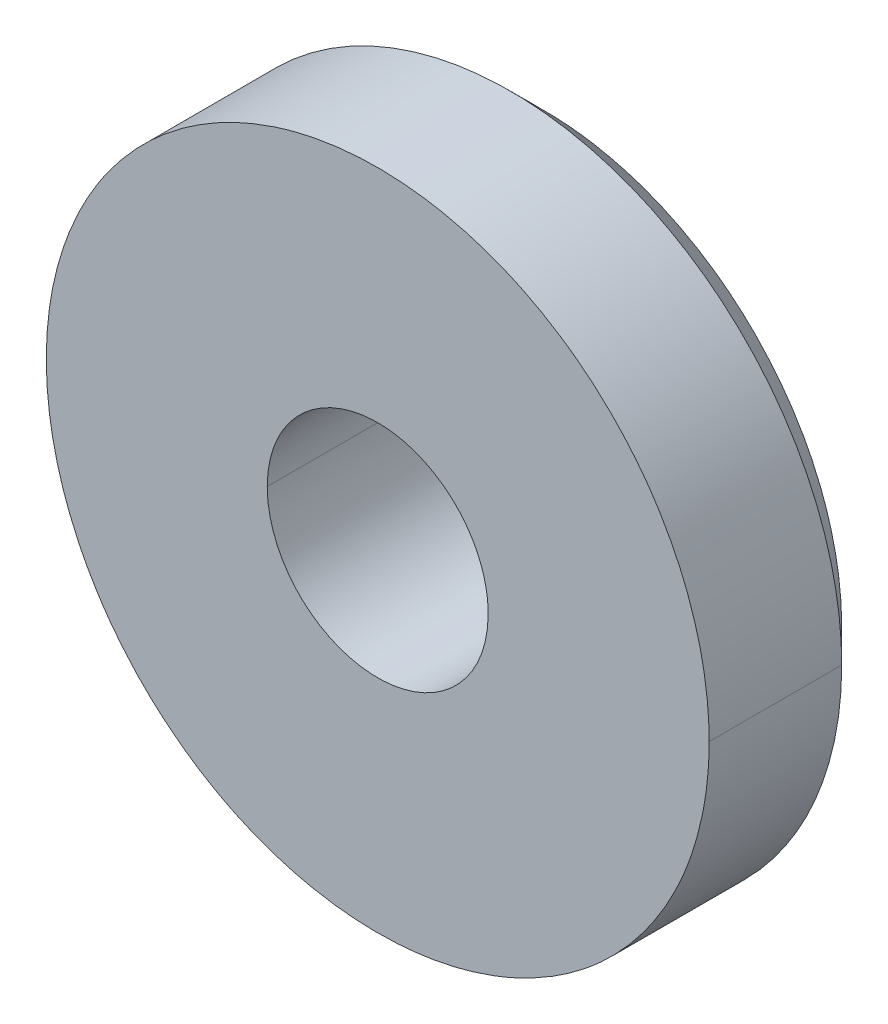
ISO-10303-21;
HEADER;
FILE_DESCRIPTION(('STEP AP214'),'2;1');
FILE_NAME('part.step','',(''),(''),'','','');
FILE_SCHEMA(('AUTOMOTIVE_DESIGN { 1 0 10303 214 1 1 1 1 }'));
ENDSEC;
DATA;
#1=APPLICATION_CONTEXT('core data for automotive mechanical design processes');
#2=APPLICATION_PROTOCOL_DEFINITION('international standard','automotive_design',2000,#1);
#3=PRODUCT_CONTEXT('',#1,'mechanical');
#4=PRODUCT('Part','Part','',(#3));
#5=PRODUCT_RELATED_PRODUCT_CATEGORY('part','',(#4));
#6=PRODUCT_DEFINITION_FORMATION('','',#4);
#7=PRODUCT_DEFINITION_CONTEXT('part definition',#1,'design');
#8=PRODUCT_DEFINITION('design','',#6,#7);
#9=PRODUCT_DEFINITION_SHAPE('','',#8);
#10=(LENGTH_UNIT() NAMED_UNIT(*) SI_UNIT(.MILLI.,.METRE.));
#11=(NAMED_UNIT(*) PLANE_ANGLE_UNIT() SI_UNIT($,.RADIAN.));
#12=(NAMED_UNIT(*) SI_UNIT($,.STERADIAN.) SOLID_ANGLE_UNIT());
#13=UNCERTAINTY_MEASURE_WITH_UNIT(LENGTH_MEASURE(1.E-05),#10,'distance_accuracy_value','');
#14=(GEOMETRIC_REPRESENTATION_CONTEXT(3) GLOBAL_UNCERTAINTY_ASSIGNED_CONTEXT((#13)) GLOBAL_UNIT_ASSIGNED_CONTEXT((#10,
#11,#12)) REPRESENTATION_CONTEXT('',''));
#15=CARTESIAN_POINT('',(0.,0.,0.));
#16=DIRECTION('',(0.,0.,1.));
#17=DIRECTION('',(1.,0.,0.));
#18=AXIS2_PLACEMENT_3D('',#15,#16,#17);
#19=CARTESIAN_POINT('',(5.13579431873,-10.5899117761,3.85520000018));
#20=CARTESIAN_POINT('',(5.13579431873,-10.5899117761,4.148));
#21=CARTESIAN_POINT('',(5.13579431873,-10.3599471939,3.85520000018));
#22=CARTESIAN_POINT('',(5.13579431873,-10.3599471939,4.148));
#23=CARTESIAN_POINT('',(5.04574733577,-10.1297680532,3.85520000018));
#24=CARTESIAN_POINT('',(5.04574733577,-10.1297680532,4.148));
#25=CARTESIAN_POINT('',(4.86372348321,-9.94795875909,3.85520000018));
#26=CARTESIAN_POINT('',(4.86372348321,-9.94795875909,4.148));
#27=CARTESIAN_POINT('',(4.40379431873,-9.76786479316,3.85520000018));
#28=CARTESIAN_POINT('',(4.40379431873,-9.76786479316,4.148));
#29=CARTESIAN_POINT('',(3.94386515424,-9.94795875909,3.85520000018));
#30=CARTESIAN_POINT('',(3.94386515424,-9.94795875909,4.148));
#31=CARTESIAN_POINT('',(3.76184130169,-10.1297680532,3.85520000018));
#32=CARTESIAN_POINT('',(3.76184130169,-10.1297680532,4.148));
#33=CARTESIAN_POINT('',(3.67179431873,-10.3599471939,3.85520000018));
#34=CARTESIAN_POINT('',(3.67179431873,-10.3599471939,4.148));
#35=CARTESIAN_POINT('',(3.67179431873,-10.5899117761,3.85520000018));
#36=CARTESIAN_POINT('',(3.67179431873,-10.5899117761,4.148));
#37=B_SPLINE_SURFACE_WITH_KNOTS('',5,1,((#19,#20),(#21,#22),(#23,#24),(#25,#26),(#27,#28),(#29,
#30),(#31,#32),(#33,#34),(#35,#36)),.UNSPECIFIED.,.F.,.F.,.F.,(6,3,6),(2,2),(0.,4.71238898038,
9.42477796077),(0.300000000745,1.5),.UNSPECIFIED.);
#38=DIRECTION('',(0.,0.,1.));
#39=VECTOR('',#38,1.);
#40=CARTESIAN_POINT('',(3.67179431873,-10.5899117761,4.00160000009));
#41=LINE('',#40,#39);
#42=CARTESIAN_POINT('',(3.67179431873,-10.5899117761,3.855200000045));
#43=VERTEX_POINT('',#42);
#44=CARTESIAN_POINT('',(3.67179431873,-10.5899117761,4.148));
#45=VERTEX_POINT('',#44);
#46=EDGE_CURVE('E75',#43,#45,#41,.T.);
#47=CARTESIAN_POINT('',(3.67179431873,-10.5899117761,4.148));
#48=CARTESIAN_POINT('',(3.67175469308199,-10.5487166760597,4.148));
#49=CARTESIAN_POINT('',(3.67525971192526,-10.5075298890437,4.148));
#50=CARTESIAN_POINT('',(3.68910743176261,-10.4263566098291,4.148));
#51=CARTESIAN_POINT('',(3.69944437984655,-10.3863691373232,4.148));
#52=CARTESIAN_POINT('',(3.72670152100169,-10.3087152441346,4.148));
#53=CARTESIAN_POINT('',(3.74361997712359,-10.2710482140914,4.148));
#54=CARTESIAN_POINT('',(3.78353255581134,-10.1990957886097,4.148));
#55=CARTESIAN_POINT('',(3.80652544235514,-10.1648097071643,4.148));
#56=CARTESIAN_POINT('',(3.85793897041344,-10.1005647694759,4.148));
#57=CARTESIAN_POINT('',(3.88636133671612,-10.0706072936312,4.148));
#58=CARTESIAN_POINT('',(3.94782365792804,-10.0158778631416,4.148));
#59=CARTESIAN_POINT('',(3.98086353165118,-9.99110581734447,4.148));
#60=CARTESIAN_POINT('',(4.05071085783293,-9.94740276513736,4.148));
#61=CARTESIAN_POINT('',(4.08752709560112,-9.92848581000149,4.148));
#62=CARTESIAN_POINT('',(4.16379036798158,-9.8971413655571,4.148));
#63=CARTESIAN_POINT('',(4.20323429385568,-9.88470635618808,4.148));
#64=CARTESIAN_POINT('',(4.27018112267461,-9.86967143503724,4.148));
#65=CARTESIAN_POINT('',(4.29727318348864,-9.86517391341129,4.148));
#66=CARTESIAN_POINT('',(4.35179180673987,-9.85924270275119,4.148));
#67=CARTESIAN_POINT('',(4.37921838818861,-9.85780918867501,4.148));
#68=CARTESIAN_POINT('',(4.44777995199007,-9.85807947471109,4.148));
#69=CARTESIAN_POINT('',(4.48892226153564,-9.86170705050045,4.148));
#70=CARTESIAN_POINT('',(4.57003928399417,-9.87583316386125,4.148));
#71=CARTESIAN_POINT('',(4.61001279597202,-9.88633852590327,4.148));
#72=CARTESIAN_POINT('',(4.68754416059158,-9.91389683695413,4.148));
#73=CARTESIAN_POINT('',(4.72510686680347,-9.93093611584628,4.148));
#74=CARTESIAN_POINT('',(4.7969045398401,-9.97110481891953,4.148));
#75=CARTESIAN_POINT('',(4.83113368019033,-9.99424465315007,4.148));
#76=CARTESIAN_POINT('',(4.89524418119335,-10.0459483902917,4.148));
#77=CARTESIAN_POINT('',(4.92512331044929,-10.0745150597757,4.148));
#78=CARTESIAN_POINT('',(4.97962067894121,-10.1362035027343,4.148));
#79=CARTESIAN_POINT('',(5.00424778600425,-10.1693174403575,4.148));
#80=CARTESIAN_POINT('',(5.04765929798942,-10.2392963843903,4.148));
#81=CARTESIAN_POINT('',(5.06642789051776,-10.2761711921112,4.148));
#82=CARTESIAN_POINT('',(5.09747930771355,-10.352549854242,4.148));
#83=CARTESIAN_POINT('',(5.10976567237419,-10.3920522603996,4.148));
#84=CARTESIAN_POINT('',(5.1243442192136,-10.4581637948058,4.148));
#85=CARTESIAN_POINT('',(5.12863782522797,-10.4843489330158,4.148));
#86=CARTESIAN_POINT('',(5.13436254607842,-10.5369898345705,4.148));
#87=CARTESIAN_POINT('',(5.13579802056077,-10.5634451237821,4.148));
#88=CARTESIAN_POINT('',(5.13579431873,-10.58991177594,4.148));
#89=B_SPLINE_CURVE_WITH_KNOTS('',3,(#47,#48,#49,#50,#51,#52,#53,#54,#55,#56,#57,#58,#59,#60,#61,
#62,#63,#64,#65,#66,#67,#68,#69,#70,#71,#72,#73,#74,#75,#76,#77,#78,#79,#80,#81,#82,#83,#84,#85,
#86,#87,#88),.UNSPECIFIED.,.F.,.F.,(4,2,2,2,2,2,2,2,2,2,2,2,2,2,2,2,2,2,2,2,4),(0.,
0.123423883437789,0.246743968464291,0.370031529702372,0.493294023745467,0.616595740019214,
0.739895288645822,0.863488482246724,0.986937967677812,1.0691644333656,1.15139559414316,
1.27468367453604,1.39809427308208,1.52124807113414,1.64461339578812,1.76804178104989,
1.89126008291658,2.01480813693823,2.13828865042107,2.21774840989233,2.2970868724106),.UNSPECIFIED.);
#90=CARTESIAN_POINT('',(5.13579431873,-10.58991177602,4.148));
#91=VERTEX_POINT('',#90);
#92=EDGE_CURVE('E23',#45,#91,#89,.T.);
#93=DIRECTION('',(0.,0.,-1.));
#94=VECTOR('',#93,1.);
#95=CARTESIAN_POINT('',(5.13579431873,-10.5899117761,4.00160000009));
#96=LINE('',#95,#94);
#97=CARTESIAN_POINT('',(5.13579431873,-10.5899117761,3.855200000045));
#98=VERTEX_POINT('',#97);
#99=EDGE_CURVE('E65',#91,#98,#96,.T.);
#100=CARTESIAN_POINT('',(5.13579431873,-10.5899117761,3.8552));
#101=CARTESIAN_POINT('',(5.13579431873,-10.3599471939,3.8552));
#102=CARTESIAN_POINT('',(5.04574733577,-10.1297680532,3.8552));
#103=CARTESIAN_POINT('',(4.86372348321,-9.94795875909,3.8552));
#104=CARTESIAN_POINT('',(4.40379431873,-9.76786479316,3.8552));
#105=CARTESIAN_POINT('',(3.94386515424,-9.94795875909,3.8552));
#106=CARTESIAN_POINT('',(3.76184130169,-10.1297680532,3.8552));
#107=CARTESIAN_POINT('',(3.67179431873,-10.3599471939,3.8552));
#108=CARTESIAN_POINT('',(3.67179431873,-10.5899117761,3.8552));
#109=B_SPLINE_CURVE_WITH_KNOTS('',5,(#100,#101,#102,#103,#104,#105,#106,#107,#108),
.UNSPECIFIED.,.F.,.F.,(6,3,6),(0.,157.079632679,314.159265359),.UNSPECIFIED.);
#110=EDGE_CURVE('E74',#43,#98,#109,.F.);
#111=ORIENTED_EDGE('',*,*,#46,.T.);
#112=ORIENTED_EDGE('',*,*,#92,.T.);
#113=ORIENTED_EDGE('',*,*,#99,.T.);
#114=ORIENTED_EDGE('',*,*,#110,.F.);
#115=EDGE_LOOP('',(#111,#112,#113,#114));
#116=FACE_BOUND('',#115,.T.);
#117=ADVANCED_FACE('F16',(#116),#37,.T.);
#118=CARTESIAN_POINT('',(5.06259431873,-10.5899117761,3.782));
#119=CARTESIAN_POINT('',(5.13579431873,-10.5899117761,3.8552));
#120=CARTESIAN_POINT('',(5.06259431873,-10.3829436521,3.782));
#121=CARTESIAN_POINT('',(5.13579431873,-10.3599471939,3.8552));
#122=CARTESIAN_POINT('',(4.98155203406,-10.1757824255,3.782));
#123=CARTESIAN_POINT('',(5.04574733577,-10.1297680532,3.8552));
#124=CARTESIAN_POINT('',(4.81773056676,-10.0121540608,3.782));
#125=CARTESIAN_POINT('',(4.86372348321,-9.94795875909,3.8552));
#126=CARTESIAN_POINT('',(4.40379431873,-9.85006949146,3.782));
#127=CARTESIAN_POINT('',(4.40379431873,-9.76786479316,3.8552));
#128=CARTESIAN_POINT('',(3.98985807069,-10.0121540608,3.782));
#129=CARTESIAN_POINT('',(3.94386515424,-9.94795875909,3.8552));
#130=CARTESIAN_POINT('',(3.82603660339,-10.1757824255,3.782));
#131=CARTESIAN_POINT('',(3.76184130169,-10.1297680532,3.8552));
#132=CARTESIAN_POINT('',(3.74499431873,-10.3829436521,3.782));
#133=CARTESIAN_POINT('',(3.67179431873,-10.3599471939,3.8552));
#134=CARTESIAN_POINT('',(3.74499431873,-10.5899117761,3.782));
#135=CARTESIAN_POINT('',(3.67179431873,-10.5899117761,3.8552));
#136=B_SPLINE_SURFACE_WITH_KNOTS('',5,1,((#118,#119),(#120,#121),(#122,#123),(#124,#125),(#126,
#127),(#128,#129),(#130,#131),(#132,#133),(#134,#135)),.UNSPECIFIED.,.F.,.F.,.F.,(6,3,6),(2,2),
(0.,157.079632679,314.159265359),(-0.212132034356,0.212132034356),.UNSPECIFIED.);
#137=DIRECTION('',(0.707106781186548,0.,0.707106781186548));
#138=VECTOR('',#137,1.);
#139=CARTESIAN_POINT('',(5.09919431873,-10.5899117761,3.8186));
#140=LINE('',#139,#138);
#141=CARTESIAN_POINT('',(5.06259431873,-10.5899117761,3.782));
#142=VERTEX_POINT('',#141);
#143=EDGE_CURVE('E237',#142,#98,#140,.T.);
#144=CARTESIAN_POINT('',(5.06259431873,-10.5899117761,3.782));
#145=CARTESIAN_POINT('',(5.06263000659541,-10.5528243009346,3.782));
#146=CARTESIAN_POINT('',(5.05947346153306,-10.5157443666266,3.782));
#147=CARTESIAN_POINT('',(5.04700261602414,-10.4426659478536,3.782));
#148=CARTESIAN_POINT('',(5.03769352540495,-10.4066665753336,3.782));
#149=CARTESIAN_POINT('',(5.01313713639721,-10.3367309923816,3.782));
#150=CARTESIAN_POINT('',(4.99788671052204,-10.3027958794597,3.782));
#151=CARTESIAN_POINT('',(4.96190575217228,-10.2379760566865,3.782));
#152=CARTESIAN_POINT('',(4.94117609352395,-10.2070908615132,3.782));
#153=CARTESIAN_POINT('',(4.89484977492206,-10.1492607013253,3.782));
#154=CARTESIAN_POINT('',(4.8692573433807,-10.1223123487854,3.782));
#155=CARTESIAN_POINT('',(4.81391791689329,-10.0730824086409,3.782));
#156=CARTESIAN_POINT('',(4.78417067818409,-10.0508010950439,3.782));
#157=CARTESIAN_POINT('',(4.72130275390996,-10.0115088325531,3.782));
#158=CARTESIAN_POINT('',(4.68817610219518,-9.99450742666181,3.782));
#159=CARTESIAN_POINT('',(4.61953535625685,-9.96632525100486,3.782));
#160=CARTESIAN_POINT('',(4.58402145420446,-9.95514401335373,3.782));
#161=CARTESIAN_POINT('',(4.51170816489156,-9.93894543437319,3.782));
#162=CARTESIAN_POINT('',(4.47491217470162,-9.93391291446303,3.782));
#163=CARTESIAN_POINT('',(4.40099913173757,-9.93007917493141,3.782));
#164=CARTESIAN_POINT('',(4.36388209228414,-9.93127769800351,3.782));
#165=CARTESIAN_POINT('',(4.29031774442204,-9.93988997941001,3.782));
#166=CARTESIAN_POINT('',(4.2538715368348,-9.94731315891201,3.782));
#167=CARTESIAN_POINT('',(4.18275018700359,-9.96818792502677,3.782));
#168=CARTESIAN_POINT('',(4.14807496630536,-9.981639244336,3.782));
#169=CARTESIAN_POINT('',(4.08153998796447,-10.0141475951209,3.782));
#170=CARTESIAN_POINT('',(4.04967519734381,-10.0331943298174,3.782));
#171=CARTESIAN_POINT('',(3.98958523290111,-10.0763545440065,3.782));
#172=CARTESIAN_POINT('',(3.96136007675336,-10.1004680481021,3.782));
#173=CARTESIAN_POINT('',(3.90928228617273,-10.1531391953839,3.782));
#174=CARTESIAN_POINT('',(3.88543992761742,-10.1817069996629,3.782));
#175=CARTESIAN_POINT('',(3.84289032214773,-10.2424403370006,3.782));
#176=CARTESIAN_POINT('',(3.82418295838556,-10.2746057881708,3.782));
#177=CARTESIAN_POINT('',(3.79243213439344,-10.3416454321421,3.782));
#178=CARTESIAN_POINT('',(3.77939250970407,-10.3765214405072,3.782));
#179=CARTESIAN_POINT('',(3.75939656101371,-10.4479278690973,3.782));
#180=CARTESIAN_POINT('',(3.75243100784517,-10.4844556903457,3.782));
#181=CARTESIAN_POINT('',(3.74618244542505,-10.5440892861822,3.782));
#182=CARTESIAN_POINT('',(3.74498359790726,-10.5670069570048,3.782));
#183=CARTESIAN_POINT('',(3.74499431873,-10.5899117761,3.782));
#184=B_SPLINE_CURVE_WITH_KNOTS('',3,(#144,#145,#146,#147,#148,#149,#150,#151,#152,#153,#154,
#155,#156,#157,#158,#159,#160,#161,#162,#163,#164,#165,#166,#167,#168,#169,#170,#171,#172,#173,
#174,#175,#176,#177,#178,#179,#180,#181,#182,#183),.UNSPECIFIED.,.F.,.F.,(4,2,2,2,2,2,2,2,2,2,2,
2,2,2,2,2,2,2,2,4),(0.,0.111116908818605,0.222139846859593,0.333221305909749,0.444285060402596,
0.555252678021256,0.666226808863394,0.777400364495693,0.888564981464977,0.999454621975982,
1.11033968341568,1.22139287562523,1.33244114393197,1.44328632589502,1.55413204610912,
1.66523442892915,1.7763342833836,1.88750920605148,1.99851490963395,2.06723138032799),.UNSPECIFIED.);
#185=CARTESIAN_POINT('',(3.74499431873,-10.5899117761,3.782));
#186=VERTEX_POINT('',#185);
#187=EDGE_CURVE('E153',#142,#186,#184,.T.);
#188=DIRECTION('',(0.707106781186548,0.,-0.707106781186548));
#189=VECTOR('',#188,1.);
#190=CARTESIAN_POINT('',(3.70839431873,-10.5899117761,3.8186));
#191=LINE('',#190,#189);
#192=EDGE_CURVE('E235',#43,#186,#191,.T.);
#193=ORIENTED_EDGE('',*,*,#143,.F.);
#194=ORIENTED_EDGE('',*,*,#187,.T.);
#195=ORIENTED_EDGE('',*,*,#192,.F.);
#196=ORIENTED_EDGE('',*,*,#110,.T.);
#197=EDGE_LOOP('',(#193,#194,#195,#196));
#198=FACE_BOUND('',#197,.T.);
#199=ADVANCED_FACE('F162',(#198),#136,.T.);
#200=CARTESIAN_POINT('',(3.74499431873,-10.5899117761,3.782));
#201=CARTESIAN_POINT('',(3.67179431873,-10.5899117761,3.8552));
#202=CARTESIAN_POINT('',(3.74499431873,-10.7968799001,3.782));
#203=CARTESIAN_POINT('',(3.67179431873,-10.8198763584,3.8552));
#204=CARTESIAN_POINT('',(3.82603660339,-11.0040411268,3.782));
#205=CARTESIAN_POINT('',(3.76184130169,-11.0500554991,3.8552));
#206=CARTESIAN_POINT('',(3.98985807069,-11.1676694915,3.782));
#207=CARTESIAN_POINT('',(3.94386515424,-11.2318647932,3.8552));
#208=CARTESIAN_POINT('',(4.40379431873,-11.3297540608,3.782));
#209=CARTESIAN_POINT('',(4.40379431873,-11.4119587591,3.8552));
#210=CARTESIAN_POINT('',(4.81773056676,-11.1676694915,3.782));
#211=CARTESIAN_POINT('',(4.86372348321,-11.2318647932,3.8552));
#212=CARTESIAN_POINT('',(4.98155203406,-11.0040411268,3.782));
#213=CARTESIAN_POINT('',(5.04574733577,-11.0500554991,3.8552));
#214=CARTESIAN_POINT('',(5.06259431873,-10.7968799001,3.782));
#215=CARTESIAN_POINT('',(5.13579431873,-10.8198763584,3.8552));
#216=CARTESIAN_POINT('',(5.06259431873,-10.5899117761,3.782));
#217=CARTESIAN_POINT('',(5.13579431873,-10.5899117761,3.8552));
#218=B_SPLINE_SURFACE_WITH_KNOTS('',5,1,((#200,#201),(#202,#203),(#204,#205),(#206,#207),(#208,
#209),(#210,#211),(#212,#213),(#214,#215),(#216,#217)),.UNSPECIFIED.,.F.,.F.,.F.,(6,3,6),(2,2),
(314.159265359,471.238898038,628.318530718),(-0.212132034358,0.212132034358),.UNSPECIFIED.);
#219=CARTESIAN_POINT('',(3.74499431873,-10.5899117761,3.782));
#220=CARTESIAN_POINT('',(3.74495863086499,-10.6269992512767,3.782));
#221=CARTESIAN_POINT('',(3.74811517592844,-10.6640791855959,3.782));
#222=CARTESIAN_POINT('',(3.76058602144092,-10.7371576043917,3.782));
#223=CARTESIAN_POINT('',(3.76989511206267,-10.7731569769232,3.782));
#224=CARTESIAN_POINT('',(3.79445150107684,-10.8430925598981,3.782));
#225=CARTESIAN_POINT('',(3.80970192695589,-10.8770276728312,3.782));
#226=CARTESIAN_POINT('',(3.84568288531591,-10.9418474956255,3.782));
#227=CARTESIAN_POINT('',(3.86641254397061,-10.9727326908086,3.782));
#228=CARTESIAN_POINT('',(3.91273886258579,-11.0305628510102,3.782));
#229=CARTESIAN_POINT('',(3.93833129413349,-11.0575112035542,3.782));
#230=CARTESIAN_POINT('',(3.99367072063574,-11.1067411437039,3.782));
#231=CARTESIAN_POINT('',(4.02341795935343,-11.1290224573018,3.782));
#232=CARTESIAN_POINT('',(4.08628588363385,-11.1683147197831,3.782));
#233=CARTESIAN_POINT('',(4.11941253534515,-11.1853161256659,3.782));
#234=CARTESIAN_POINT('',(4.18805328127511,-11.2134983013069,3.782));
#235=CARTESIAN_POINT('',(4.2235671833226,-11.2246795389505,3.782));
#236=CARTESIAN_POINT('',(4.29588047262573,-11.2408781179185,3.782));
#237=CARTESIAN_POINT('',(4.33267646281086,-11.2459106378235,3.782));
#238=CARTESIAN_POINT('',(4.40658950576459,-11.2497443773479,3.782));
#239=CARTESIAN_POINT('',(4.44370654521249,-11.2485458542738,3.782));
#240=CARTESIAN_POINT('',(4.51727089307502,-11.2399335728647,3.782));
#241=CARTESIAN_POINT('',(4.55371710066799,-11.23251039336,3.782));
#242=CARTESIAN_POINT('',(4.62483845050951,-11.2116356272376,3.782));
#243=CARTESIAN_POINT('',(4.65951367121233,-11.1981843079233,3.782));
#244=CARTESIAN_POINT('',(4.72604864955295,-11.1656759571293,3.782));
#245=CARTESIAN_POINT('',(4.75791344016936,-11.14662922243,3.782));
#246=CARTESIAN_POINT('',(4.81800340460253,-11.1034690082353,3.782));
#247=CARTESIAN_POINT('',(4.846228560745,-11.0793555041369,3.782));
#248=CARTESIAN_POINT('',(4.89830635131118,-11.0266843568538,3.782));
#249=CARTESIAN_POINT('',(4.92214870985789,-10.9981165525769,3.782));
#250=CARTESIAN_POINT('',(4.9646983153126,-10.9373832152456,3.782));
#251=CARTESIAN_POINT('',(4.98340567906837,-10.9052177640799,3.782));
#252=CARTESIAN_POINT('',(5.0151565030564,-10.8381781201094,3.782));
#253=CARTESIAN_POINT('',(5.02819612774638,-10.80330211174,3.782));
#254=CARTESIAN_POINT('',(5.04819207643928,-10.7318956831417,3.782));
#255=CARTESIAN_POINT('',(5.05515762960975,-10.6953678618892,3.782));
#256=CARTESIAN_POINT('',(5.0614061920337,-10.6357342660385,3.782));
#257=CARTESIAN_POINT('',(5.06260503955262,-10.6128165952056,3.782));
#258=CARTESIAN_POINT('',(5.06259431873,-10.5899117761,3.782));
#259=B_SPLINE_CURVE_WITH_KNOTS('',3,(#219,#220,#221,#222,#223,#224,#225,#226,#227,#228,#229,
#230,#231,#232,#233,#234,#235,#236,#237,#238,#239,#240,#241,#242,#243,#244,#245,#246,#247,#248,
#249,#250,#251,#252,#253,#254,#255,#256,#257,#258),.UNSPECIFIED.,.F.,.F.,(4,2,2,2,2,2,2,2,2,2,2,
2,2,2,2,2,2,2,2,4),(0.,0.111116908852408,0.222139846928839,0.333221306014288,0.444285060541963,
0.555252678182336,0.666226809045976,0.777400364657522,0.888564981606224,0.999454622101198,
1.110339683525,1.22139287575271,1.33244114407729,1.44328632603364,1.55413204624098,
1.66523442904014,1.77633428347404,1.88750920615499,1.99851490975035,2.0672313804754),.UNSPECIFIED.);
#260=EDGE_CURVE('E158',#186,#142,#259,.T.);
#261=CARTESIAN_POINT('',(3.67179431873,-10.5899117761,3.8552));
#262=CARTESIAN_POINT('',(3.67179431873,-10.8198763584,3.8552));
#263=CARTESIAN_POINT('',(3.76184130169,-11.0500554991,3.8552));
#264=CARTESIAN_POINT('',(3.94386515424,-11.2318647932,3.8552));
#265=CARTESIAN_POINT('',(4.40379431873,-11.4119587591,3.8552));
#266=CARTESIAN_POINT('',(4.86372348321,-11.2318647932,3.8552));
#267=CARTESIAN_POINT('',(5.04574733577,-11.0500554991,3.8552));
#268=CARTESIAN_POINT('',(5.13579431873,-10.8198763584,3.8552));
#269=CARTESIAN_POINT('',(5.13579431873,-10.5899117761,3.8552));
#270=B_SPLINE_CURVE_WITH_KNOTS('',5,(#261,#262,#263,#264,#265,#266,#267,#268,#269),
.UNSPECIFIED.,.F.,.F.,(6,3,6),(9.42477796077,14.1371669412,18.8495559215),.UNSPECIFIED.);
#271=EDGE_CURVE('E152',#43,#98,#270,.T.);
#272=ORIENTED_EDGE('',*,*,#192,.T.);
#273=ORIENTED_EDGE('',*,*,#260,.T.);
#274=ORIENTED_EDGE('',*,*,#143,.T.);
#275=ORIENTED_EDGE('',*,*,#271,.F.);
#276=EDGE_LOOP('',(#272,#273,#274,#275));
#277=FACE_BOUND('',#276,.T.);
#278=ADVANCED_FACE('F125',(#277),#218,.T.);
#279=CARTESIAN_POINT('',(4.40379431873,-10.5899117761,3.782));
#280=DIRECTION('',(0.,0.,1.));
#281=DIRECTION('',(1.,0.,0.));
#282=AXIS2_PLACEMENT_3D('',#279,#280,#281);
#283=PLANE('',#282);
#284=CARTESIAN_POINT('',(4.15979431873,-10.5899117761,3.782));
#285=CARTESIAN_POINT('',(4.15978229840674,-10.6036308259368,3.782));
#286=CARTESIAN_POINT('',(4.16094777693785,-10.6173460851539,3.782));
#287=CARTESIAN_POINT('',(4.16555360134247,-10.644377595904,3.782));
#288=CARTESIAN_POINT('',(4.16899202518919,-10.6576941746291,3.782));
#289=CARTESIAN_POINT('',(4.17806623307511,-10.6835681333033,3.782));
#290=CARTESIAN_POINT('',(4.18370316813148,-10.6961251115839,3.782));
#291=CARTESIAN_POINT('',(4.19698869075978,-10.7201054457722,3.782));
#292=CARTESIAN_POINT('',(4.20463696756199,-10.731528976432,3.782));
#293=CARTESIAN_POINT('',(4.23031473640211,-10.7636117217623,3.782));
#294=CARTESIAN_POINT('',(4.25110735936021,-10.782167073025,3.782));
#295=CARTESIAN_POINT('',(4.29766449589915,-10.8113371756545,3.782));
#296=CARTESIAN_POINT('',(4.32343770656139,-10.8219378761744,3.782));
#297=CARTESIAN_POINT('',(4.37698304866845,-10.8339826546247,3.782));
#298=CARTESIAN_POINT('',(4.40475002551695,-10.8354495416491,3.782));
#299=CARTESIAN_POINT('',(4.45924608508106,-10.8291084021172,3.782));
#300=CARTESIAN_POINT('',(4.48597362015719,-10.8212870540478,3.782));
#301=CARTESIAN_POINT('',(4.53527511882909,-10.7972658479974,3.782));
#302=CARTESIAN_POINT('',(4.55785652271114,-10.7810812012255,3.782));
#303=CARTESIAN_POINT('',(4.59647201800099,-10.7420656057834,3.782));
#304=CARTESIAN_POINT('',(4.61249105769765,-10.7192195813032,3.782));
#305=CARTESIAN_POINT('',(4.63015701432713,-10.682048257081,3.782));
#306=CARTESIAN_POINT('',(4.63498865517893,-10.6691438071604,3.782));
#307=CARTESIAN_POINT('',(4.64241072701579,-10.6427097335572,3.782));
#308=CARTESIAN_POINT('',(4.64500453780125,-10.6291810852762,3.782));
#309=CARTESIAN_POINT('',(4.647347721589,-10.6070239330426,3.782));
#310=CARTESIAN_POINT('',(4.6477997317329,-10.5984646057958,3.782));
#311=CARTESIAN_POINT('',(4.64779431873,-10.5899117761,3.782));
#312=B_SPLINE_CURVE_WITH_KNOTS('',3,(#284,#285,#286,#287,#288,#289,#290,#291,#292,#293,#294,
#295,#296,#297,#298,#299,#300,#301,#302,#303,#304,#305,#306,#307,#308,#309,#310,#311),
.UNSPECIFIED.,.F.,.F.,(4,2,2,2,2,2,2,2,2,2,2,2,2,4),(0.,0.0411014434365658,0.0821681754383699,
0.123256436601507,0.16433835299845,0.246247380852865,0.328300751874495,0.41014913555521,
0.492115050977186,0.5739324083887,0.655936388746973,0.697112382821875,0.738226079276587,
0.763888788680827),.UNSPECIFIED.);
#313=CARTESIAN_POINT('',(4.15979431873,-10.5899117761,3.782));
#314=VERTEX_POINT('',#313);
#315=CARTESIAN_POINT('',(4.64779431873,-10.5899117761,3.782));
#316=VERTEX_POINT('',#315);
#317=EDGE_CURVE('E114',#314,#316,#312,.T.);
#318=ORIENTED_EDGE('',*,*,#317,.T.);
#319=CARTESIAN_POINT('',(4.64779431873,-10.5899117761,3.782));
#320=CARTESIAN_POINT('',(4.64780746501311,-10.5761934898536,3.782));
#321=CARTESIAN_POINT('',(4.64664143785449,-10.5624779772609,3.782));
#322=CARTESIAN_POINT('',(4.64203451673201,-10.5354457845361,3.782));
#323=CARTESIAN_POINT('',(4.63859551643983,-10.5221287820406,3.782));
#324=CARTESIAN_POINT('',(4.62952341848153,-10.4962557800983,3.782));
#325=CARTESIAN_POINT('',(4.62388913176521,-10.4837001973315,3.782));
#326=CARTESIAN_POINT('',(4.61059563460199,-10.4597151768181,3.782));
#327=CARTESIAN_POINT('',(4.60293683575615,-10.4482855108102,3.782));
#328=CARTESIAN_POINT('',(4.58580861842005,-10.4268659454352,3.782));
#329=CARTESIAN_POINT('',(4.57633837511368,-10.4168767055941,3.782));
#330=CARTESIAN_POINT('',(4.55585848035651,-10.3986257284843,3.782));
#331=CARTESIAN_POINT('',(4.54484879813923,-10.3903640257494,3.782));
#332=CARTESIAN_POINT('',(4.52156989989649,-10.3757871594677,3.782));
#333=CARTESIAN_POINT('',(4.50929774450963,-10.3694766821187,3.782));
#334=CARTESIAN_POINT('',(4.48388682089602,-10.3590189066859,3.782));
#335=CARTESIAN_POINT('',(4.47074910637401,-10.3548690312299,3.782));
#336=CARTESIAN_POINT('',(4.43979360537002,-10.3479102738705,3.782));
#337=CARTESIAN_POINT('',(4.42178533820819,-10.3459134220985,3.782));
#338=CARTESIAN_POINT('',(4.39008274179142,-10.3459105216277,3.782));
#339=CARTESIAN_POINT('',(4.37638118315302,-10.3470681804773,3.782));
#340=CARTESIAN_POINT('',(4.34935758089106,-10.3516601504024,3.782));
#341=CARTESIAN_POINT('',(4.33603594095883,-10.3550967954662,3.782));
#342=CARTESIAN_POINT('',(4.29726714639355,-10.3687097784356,3.782));
#343=CARTESIAN_POINT('',(4.27289953817692,-10.3821900200101,3.782));
#344=CARTESIAN_POINT('',(4.23001028349543,-10.4164844113232,3.782));
#345=CARTESIAN_POINT('',(4.21149169728233,-10.437302388207,3.782));
#346=CARTESIAN_POINT('',(4.18965263401759,-10.4721514506301,3.782));
#347=CARTESIAN_POINT('',(4.18335388303081,-10.4844093737435,3.782));
#348=CARTESIAN_POINT('',(4.17290295679593,-10.5098201833518,3.782));
#349=CARTESIAN_POINT('',(4.16874967287928,-10.5229726036313,3.782));
#350=CARTESIAN_POINT('',(4.16375910029422,-10.5451568832651,3.782));
#351=CARTESIAN_POINT('',(4.16227253303165,-10.5540491731593,3.782));
#352=CARTESIAN_POINT('',(4.16029041958732,-10.5719302028036,3.782));
#353=CARTESIAN_POINT('',(4.15979340705174,-10.5809187799694,3.782));
#354=CARTESIAN_POINT('',(4.15979431873,-10.5899117761,3.782));
#355=B_SPLINE_CURVE_WITH_KNOTS('',3,(#319,#320,#321,#322,#323,#324,#325,#326,#327,#328,#329,
#330,#331,#332,#333,#334,#335,#336,#337,#338,#339,#340,#341,#342,#343,#344,#345,#346,#347,#348,
#349,#350,#351,#352,#353,#354),.UNSPECIFIED.,.F.,.F.,(4,2,2,2,2,2,2,2,2,2,2,2,2,2,2,2,2,4),(0.,
0.0411011873918704,0.082168175430603,0.12325743789514,0.164338352968929,0.205438018389103,
0.246538505324673,0.287736948779389,0.328886133540974,0.382765464927416,0.423828763124613,
0.464934180742063,0.546812467484043,0.628733522860417,0.669916143544873,0.711077461798144,
0.738073963057838,0.765030430176466),.UNSPECIFIED.);
#356=EDGE_CURVE('E146',#316,#314,#355,.T.);
#357=ORIENTED_EDGE('',*,*,#356,.T.);
#358=EDGE_LOOP('',(#318,#357));
#359=FACE_BOUND('',#358,.T.);
#360=ORIENTED_EDGE('',*,*,#260,.F.);
#361=ORIENTED_EDGE('',*,*,#187,.F.);
#362=EDGE_LOOP('',(#360,#361));
#363=FACE_BOUND('',#362,.T.);
#364=ADVANCED_FACE('F104',(#359,#363),#283,.F.);
#365=CARTESIAN_POINT('',(3.67179431873,-10.5899117761,3.8552));
#366=CARTESIAN_POINT('',(3.67179431873,-10.5899117761,4.148));
#367=CARTESIAN_POINT('',(3.67179431873,-10.8198763584,3.8552));
#368=CARTESIAN_POINT('',(3.67179431873,-10.8198763584,4.148));
#369=CARTESIAN_POINT('',(3.76184130169,-11.0500554991,3.8552));
#370=CARTESIAN_POINT('',(3.76184130169,-11.0500554991,4.148));
#371=CARTESIAN_POINT('',(3.94386515424,-11.2318647932,3.8552));
#372=CARTESIAN_POINT('',(3.94386515424,-11.2318647932,4.148));
#373=CARTESIAN_POINT('',(4.40379431873,-11.4119587591,3.8552));
#374=CARTESIAN_POINT('',(4.40379431873,-11.4119587591,4.148));
#375=CARTESIAN_POINT('',(4.86372348321,-11.2318647932,3.8552));
#376=CARTESIAN_POINT('',(4.86372348321,-11.2318647932,4.148));
#377=CARTESIAN_POINT('',(5.04574733577,-11.0500554991,3.8552));
#378=CARTESIAN_POINT('',(5.04574733577,-11.0500554991,4.148));
#379=CARTESIAN_POINT('',(5.13579431873,-10.8198763584,3.8552));
#380=CARTESIAN_POINT('',(5.13579431873,-10.8198763584,4.148));
#381=CARTESIAN_POINT('',(5.13579431873,-10.5899117761,3.8552));
#382=CARTESIAN_POINT('',(5.13579431873,-10.5899117761,4.148));
#383=B_SPLINE_SURFACE_WITH_KNOTS('',5,1,((#365,#366),(#367,#368),(#369,#370),(#371,#372),(#373,
#374),(#375,#376),(#377,#378),(#379,#380),(#381,#382)),.UNSPECIFIED.,.F.,.F.,.F.,(6,3,6),(2,2),
(9.42477796077,14.1371669412,18.8495559215),(0.3,1.5),.UNSPECIFIED.);
#384=CARTESIAN_POINT('',(3.67179431873,-10.5899117761,4.148));
#385=CARTESIAN_POINT('',(3.67175469748472,-10.6311071161397,4.148));
#386=CARTESIAN_POINT('',(3.67525975506645,-10.6722941434961,4.148));
#387=CARTESIAN_POINT('',(3.68910754989197,-10.7534674098759,4.148));
#388=CARTESIAN_POINT('',(3.69944445468566,-10.7934546427673,4.148));
#389=CARTESIAN_POINT('',(3.72670120541137,-10.8711073944323,4.148));
#390=CARTESIAN_POINT('',(3.74361919806685,-10.9087735633761,4.148));
#391=CARTESIAN_POINT('',(3.78353145302587,-10.9807261457286,4.148));
#392=CARTESIAN_POINT('',(3.80652476492802,-11.015013086621,4.148));
#393=CARTESIAN_POINT('',(3.85793804186794,-11.0792575345133,4.148));
#394=CARTESIAN_POINT('',(3.88635939301472,-11.1092139322214,4.148));
#395=CARTESIAN_POINT('',(3.94782079293971,-11.1639437335846,4.148));
#396=CARTESIAN_POINT('',(3.9808611205249,-11.1887168241434,4.148));
#397=CARTESIAN_POINT('',(4.05069299957037,-11.2324090144337,4.148));
#398=CARTESIAN_POINT('',(4.08749119742872,-11.2513174946786,4.148));
#399=CARTESIAN_POINT('',(4.16374344081866,-11.2826683812737,4.148));
#400=CARTESIAN_POINT('',(4.20319727085179,-11.2951113115757,4.148));
#401=CARTESIAN_POINT('',(4.28353671935212,-11.3131490934978,4.148));
#402=CARTESIAN_POINT('',(4.32441855903652,-11.3187607904737,4.148));
#403=CARTESIAN_POINT('',(4.40654235787899,-11.3230605654946,4.148));
#404=CARTESIAN_POINT('',(4.44778430215139,-11.32174892839,4.148));
#405=CARTESIAN_POINT('',(4.52952718746632,-11.31221956012,4.148));
#406=CARTESIAN_POINT('',(4.57002691493175,-11.3039913987479,4.148));
#407=CARTESIAN_POINT('',(4.64906179531687,-11.2808358885433,4.148));
#408=CARTESIAN_POINT('',(4.68759703577511,-11.2659088385078,4.148));
#409=CARTESIAN_POINT('',(4.76154235108579,-11.2298246149677,4.148));
#410=CARTESIAN_POINT('',(4.79695800466854,-11.2086788688399,4.148));
#411=CARTESIAN_POINT('',(4.86374806725367,-11.1607555602913,4.148));
#412=CARTESIAN_POINT('',(4.89512245492108,-11.1339779681403,4.148));
#413=CARTESIAN_POINT('',(4.95301548975863,-11.0754824657589,4.148));
#414=CARTESIAN_POINT('',(4.97952266482072,-11.0437532016055,4.148));
#415=CARTESIAN_POINT('',(5.02683287303809,-10.9762941887942,4.148));
#416=CARTESIAN_POINT('',(5.04763622428479,-10.9405646633799,4.148));
#417=CARTESIAN_POINT('',(5.08294997655929,-10.8660969103682,4.148));
#418=CARTESIAN_POINT('',(5.09745597995728,-10.8273566024372,4.148));
#419=CARTESIAN_POINT('',(5.11971668549411,-10.7480164509264,4.148));
#420=CARTESIAN_POINT('',(5.1274815957949,-10.7074195173619,4.148));
#421=CARTESIAN_POINT('',(5.13312129139145,-10.6537804635756,4.148));
#422=CARTESIAN_POINT('',(5.13412447172454,-10.6410159844713,4.148));
#423=CARTESIAN_POINT('',(5.13546005798495,-10.6154733060401,4.148));
#424=CARTESIAN_POINT('',(5.13579358015061,-10.6026951651271,4.148));
#425=CARTESIAN_POINT('',(5.13579431873,-10.58991177594,4.148));
#426=B_SPLINE_CURVE_WITH_KNOTS('',3,(#384,#385,#386,#387,#388,#389,#390,#391,#392,#393,#394,
#395,#396,#397,#398,#399,#400,#401,#402,#403,#404,#405,#406,#407,#408,#409,#410,#411,#412,#413,
#414,#415,#416,#417,#418,#419,#420,#421,#422,#423,#424,#425),.UNSPECIFIED.,.F.,.F.,(4,2,2,2,2,2,
2,2,2,2,2,2,2,2,2,2,2,2,2,2,4),(0.,0.12342460108306,0.246743968610754,0.370028633724604,
0.493294024029805,0.616590933685691,0.739895288907431,0.863421634258464,0.986937967786753,
1.11014909740716,1.23335515772689,1.35674734836718,1.48013403577336,1.60329539159364,
1.72645739759038,1.84990607322557,1.97334786296173,2.09687571773259,2.22021618405464,
2.2586155359306,2.2969508274639),.UNSPECIFIED.);
#427=EDGE_CURVE('E71',#45,#91,#426,.T.);
#428=ORIENTED_EDGE('',*,*,#99,.F.);
#429=ORIENTED_EDGE('',*,*,#427,.F.);
#430=ORIENTED_EDGE('',*,*,#46,.F.);
#431=ORIENTED_EDGE('',*,*,#271,.T.);
#432=EDGE_LOOP('',(#428,#429,#430,#431));
#433=FACE_BOUND('',#432,.T.);
#434=ADVANCED_FACE('F77',(#433),#383,.T.);
#435=CARTESIAN_POINT('',(4.64779431873,-10.5899117761,3.782));
#436=CARTESIAN_POINT('',(4.64779431873,-10.5899117761,4.148));
#437=CARTESIAN_POINT('',(4.64779431873,-10.5132569154,3.782));
#438=CARTESIAN_POINT('',(4.64779431873,-10.5132569154,4.148));
#439=CARTESIAN_POINT('',(4.61777865774,-10.4365305351,3.782));
#440=CARTESIAN_POINT('',(4.61777865774,-10.4365305351,4.148));
#441=CARTESIAN_POINT('',(4.55710404022,-10.3759274371,3.782));
#442=CARTESIAN_POINT('',(4.55710404022,-10.3759274371,4.148));
#443=CARTESIAN_POINT('',(4.40379431873,-10.3158961151,3.782));
#444=CARTESIAN_POINT('',(4.40379431873,-10.3158961151,4.148));
#445=CARTESIAN_POINT('',(4.25048459723,-10.3759274371,3.782));
#446=CARTESIAN_POINT('',(4.25048459723,-10.3759274371,4.148));
#447=CARTESIAN_POINT('',(4.18980997971,-10.4365305351,3.782));
#448=CARTESIAN_POINT('',(4.18980997971,-10.4365305351,4.148));
#449=CARTESIAN_POINT('',(4.15979431873,-10.5132569154,3.782));
#450=CARTESIAN_POINT('',(4.15979431873,-10.5132569154,4.148));
#451=CARTESIAN_POINT('',(4.15979431873,-10.5899117761,3.782));
#452=CARTESIAN_POINT('',(4.15979431873,-10.5899117761,4.148));
#453=B_SPLINE_SURFACE_WITH_KNOTS('',5,1,((#435,#436),(#437,#438),(#439,#440),(#441,#442),(#443,
#444),(#445,#446),(#447,#448),(#449,#450),(#451,#452)),.UNSPECIFIED.,.F.,.F.,.F.,(6,3,6),(2,2),
(0.,1.57079632679,3.14159265359),(0.,1.5),.UNSPECIFIED.);
#454=DIRECTION('',(0.,0.,1.));
#455=VECTOR('',#454,1.);
#456=CARTESIAN_POINT('',(4.64779431873,-10.5899117761,3.965));
#457=LINE('',#456,#455);
#458=CARTESIAN_POINT('',(4.64779431873,-10.5899117761,4.148));
#459=VERTEX_POINT('',#458);
#460=EDGE_CURVE('E79',#316,#459,#457,.T.);
#461=CARTESIAN_POINT('',(4.15979431873,-10.5899117761,4.148));
#462=CARTESIAN_POINT('',(4.15978117244686,-10.5761934898529,4.148));
#463=CARTESIAN_POINT('',(4.16094719960525,-10.5624779772593,4.148));
#464=CARTESIAN_POINT('',(4.16555412072726,-10.5354457845326,4.148));
#465=CARTESIAN_POINT('',(4.16899312101922,-10.5221287820361,4.148));
#466=CARTESIAN_POINT('',(4.17806521897749,-10.4962557800918,4.148));
#467=CARTESIAN_POINT('',(4.18369950569403,-10.483700197324,4.148));
#468=CARTESIAN_POINT('',(4.19699300285821,-10.4597151768088,4.148));
#469=CARTESIAN_POINT('',(4.20465180170478,-10.4482855108002,4.148));
#470=CARTESIAN_POINT('',(4.22178001904134,-10.426865945426,4.148));
#471=CARTESIAN_POINT('',(4.23125026234714,-10.4168767055863,4.148));
#472=CARTESIAN_POINT('',(4.25173015710295,-10.3986257284789,4.148));
#473=CARTESIAN_POINT('',(4.26273983931943,-10.3903640257452,4.148));
#474=CARTESIAN_POINT('',(4.28601873756036,-10.3757871594656,4.148));
#475=CARTESIAN_POINT('',(4.29829089294619,-10.3694766821176,4.148));
#476=CARTESIAN_POINT('',(4.32370181655753,-10.3590189066862,4.148));
#477=CARTESIAN_POINT('',(4.33683953107829,-10.3548690312306,4.148));
#478=CARTESIAN_POINT('',(4.36779503208389,-10.3479102738705,4.148));
#479=CARTESIAN_POINT('',(4.38580329924879,-10.3459134220982,4.148));
#480=CARTESIAN_POINT('',(4.41750589566814,-10.345910521628,4.148));
#481=CARTESIAN_POINT('',(4.43120745430608,-10.3470681804777,4.148));
#482=CARTESIAN_POINT('',(4.45823105656707,-10.3516601504032,4.148));
#483=CARTESIAN_POINT('',(4.4715526964988,-10.3550967954672,4.148));
#484=CARTESIAN_POINT('',(4.51032149106245,-10.368709778437,4.148));
#485=CARTESIAN_POINT('',(4.53468909927787,-10.3821900200116,4.148));
#486=CARTESIAN_POINT('',(4.57757835395867,-10.4164844113245,4.148));
#487=CARTESIAN_POINT('',(4.59609694017202,-10.4373023882083,4.148));
#488=CARTESIAN_POINT('',(4.61793600343879,-10.4721514506324,4.148));
#489=CARTESIAN_POINT('',(4.62423475442669,-10.484409373747,4.148));
#490=CARTESIAN_POINT('',(4.63468568066348,-10.509820183358,4.148));
#491=CARTESIAN_POINT('',(4.63883896458089,-10.522972603639,4.148));
#492=CARTESIAN_POINT('',(4.64382953716609,-10.5451568832728,4.148));
#493=CARTESIAN_POINT('',(4.64531610442851,-10.5540491731654,4.148));
#494=CARTESIAN_POINT('',(4.64729821787268,-10.5719302028066,4.148));
#495=CARTESIAN_POINT('',(4.64779523040826,-10.5809187799709,4.148));
#496=CARTESIAN_POINT('',(4.64779431873,-10.5899117761,4.148));
#497=B_SPLINE_CURVE_WITH_KNOTS('',3,(#461,#462,#463,#464,#465,#466,#467,#468,#469,#470,#471,
#472,#473,#474,#475,#476,#477,#478,#479,#480,#481,#482,#483,#484,#485,#486,#487,#488,#489,#490,
#491,#492,#493,#494,#495,#496),.UNSPECIFIED.,.F.,.F.,(4,2,2,2,2,2,2,2,2,2,2,2,2,2,2,2,2,4),(0.,
0.0411011873942863,0.0821681754357453,0.123257437903348,0.164338352980056,0.205438018396182,
0.246538505327722,0.287736948778517,0.328886133536224,0.382765464931686,0.423828763127565,
0.464934180743652,0.546812467482872,0.628733522860074,0.669916143549417,0.711077461807442,
0.738073963062467,0.765030430176542),.UNSPECIFIED.);
#498=CARTESIAN_POINT('',(4.15979431873,-10.5899117761,4.148));
#499=VERTEX_POINT('',#498);
#500=EDGE_CURVE('E34',#499,#459,#497,.T.);
#501=DIRECTION('',(0.,0.,-1.));
#502=VECTOR('',#501,1.);
#503=CARTESIAN_POINT('',(4.15979431873,-10.5899117761,3.965));
#504=LINE('',#503,#502);
#505=EDGE_CURVE('E151',#499,#314,#504,.T.);
#506=ORIENTED_EDGE('',*,*,#356,.F.);
#507=ORIENTED_EDGE('',*,*,#460,.T.);
#508=ORIENTED_EDGE('',*,*,#500,.F.);
#509=ORIENTED_EDGE('',*,*,#505,.T.);
#510=EDGE_LOOP('',(#506,#507,#508,#509));
#511=FACE_BOUND('',#510,.T.);
#512=ADVANCED_FACE('F124',(#511),#453,.F.);
#513=CARTESIAN_POINT('',(4.15979431873,-10.5899117761,3.782));
#514=CARTESIAN_POINT('',(4.15979431873,-10.5899117761,4.148));
#515=CARTESIAN_POINT('',(4.15979431873,-10.6665666369,3.782));
#516=CARTESIAN_POINT('',(4.15979431873,-10.6665666369,4.148));
#517=CARTESIAN_POINT('',(4.18980997971,-10.7432930171,3.782));
#518=CARTESIAN_POINT('',(4.18980997971,-10.7432930171,4.148));
#519=CARTESIAN_POINT('',(4.25048459723,-10.8038961151,3.782));
#520=CARTESIAN_POINT('',(4.25048459723,-10.8038961151,4.148));
#521=CARTESIAN_POINT('',(4.40379431873,-10.8639274371,3.782));
#522=CARTESIAN_POINT('',(4.40379431873,-10.8639274371,4.148));
#523=CARTESIAN_POINT('',(4.55710404022,-10.8038961151,3.782));
#524=CARTESIAN_POINT('',(4.55710404022,-10.8038961151,4.148));
#525=CARTESIAN_POINT('',(4.61777865774,-10.7432930171,3.782));
#526=CARTESIAN_POINT('',(4.61777865774,-10.7432930171,4.148));
#527=CARTESIAN_POINT('',(4.64779431873,-10.6665666369,3.782));
#528=CARTESIAN_POINT('',(4.64779431873,-10.6665666369,4.148));
#529=CARTESIAN_POINT('',(4.64779431873,-10.5899117761,3.782));
#530=CARTESIAN_POINT('',(4.64779431873,-10.5899117761,4.148));
#531=B_SPLINE_SURFACE_WITH_KNOTS('',5,1,((#513,#514),(#515,#516),(#517,#518),(#519,#520),(#521,
#522),(#523,#524),(#525,#526),(#527,#528),(#529,#530)),.UNSPECIFIED.,.F.,.F.,.F.,(6,3,6),(2,2),
(3.14159265359,4.71238898038,6.28318530718),(0.,1.5),.UNSPECIFIED.);
#532=CARTESIAN_POINT('',(4.64779431873,-10.5899117761,4.148));
#533=CARTESIAN_POINT('',(4.64780633905324,-10.603630825936,4.148));
#534=CARTESIAN_POINT('',(4.6466408605219,-10.6173460851522,4.148));
#535=CARTESIAN_POINT('',(4.64203503611682,-10.6443775959005,4.148));
#536=CARTESIAN_POINT('',(4.63859661226988,-10.6576941746245,4.148));
#537=CARTESIAN_POINT('',(4.62952240438396,-10.6835681332967,4.148));
#538=CARTESIAN_POINT('',(4.62388546932782,-10.6961251115762,4.148));
#539=CARTESIAN_POINT('',(4.6105999467005,-10.7201054457627,4.148));
#540=CARTESIAN_POINT('',(4.60295166989902,-10.7315289764218,4.148));
#541=CARTESIAN_POINT('',(4.57727390105895,-10.7636117217542,4.148));
#542=CARTESIAN_POINT('',(4.55648127809961,-10.7821670730194,4.148));
#543=CARTESIAN_POINT('',(4.50992414155708,-10.8113371756531,4.148));
#544=CARTESIAN_POINT('',(4.48415093089248,-10.8219378761747,4.148));
#545=CARTESIAN_POINT('',(4.43060558878322,-10.833982654625,4.148));
#546=CARTESIAN_POINT('',(4.4028386119351,-10.835449541649,4.148));
#547=CARTESIAN_POINT('',(4.34834255237184,-10.8291084021169,4.148));
#548=CARTESIAN_POINT('',(4.32161501729619,-10.8212870540478,4.148));
#549=CARTESIAN_POINT('',(4.2723135186235,-10.7972658479976,4.148));
#550=CARTESIAN_POINT('',(4.24973211474042,-10.7810812012251,4.148));
#551=CARTESIAN_POINT('',(4.21111661945178,-10.7420656057826,4.148));
#552=CARTESIAN_POINT('',(4.19509757975676,-10.719219581303,4.148));
#553=CARTESIAN_POINT('',(4.17743162313022,-10.6820482570829,4.148));
#554=CARTESIAN_POINT('',(4.17259998227954,-10.6691438071638,4.148));
#555=CARTESIAN_POINT('',(4.16517791044431,-10.6427097335637,4.148));
#556=CARTESIAN_POINT('',(4.16258409965938,-10.6291810852842,4.148));
#557=CARTESIAN_POINT('',(4.16024091587119,-10.6070239330491,4.148));
#558=CARTESIAN_POINT('',(4.15978890572709,-10.5984646057991,4.148));
#559=CARTESIAN_POINT('',(4.15979431873,-10.5899117761,4.148));
#560=B_SPLINE_CURVE_WITH_KNOTS('',3,(#532,#533,#534,#535,#536,#537,#538,#539,#540,#541,#542,
#543,#544,#545,#546,#547,#548,#549,#550,#551,#552,#553,#554,#555,#556,#557,#558,#559),
.UNSPECIFIED.,.F.,.F.,(4,2,2,2,2,2,2,2,2,2,2,2,2,4),(0.,0.0411014434340781,0.0821681754330928,
0.123256436593103,0.164338352987068,0.2462473808493,0.328300751878673,0.410149135558196,
0.492115050978871,0.573932408393408,0.655936388747102,0.697112382816917,0.738226079266685,
0.763888788680662),.UNSPECIFIED.);
#561=EDGE_CURVE('E11',#459,#499,#560,.T.);
#562=ORIENTED_EDGE('',*,*,#317,.F.);
#563=ORIENTED_EDGE('',*,*,#505,.F.);
#564=ORIENTED_EDGE('',*,*,#561,.F.);
#565=ORIENTED_EDGE('',*,*,#460,.F.);
#566=EDGE_LOOP('',(#562,#563,#564,#565));
#567=FACE_BOUND('',#566,.T.);
#568=ADVANCED_FACE('F18',(#567),#531,.F.);
#569=CARTESIAN_POINT('',(4.40379431873,-10.5899117761,4.148));
#570=DIRECTION('',(0.,0.,1.));
#571=DIRECTION('',(1.,0.,0.));
#572=AXIS2_PLACEMENT_3D('',#569,#570,#571);
#573=PLANE('',#572);
#574=ORIENTED_EDGE('',*,*,#500,.T.);
#575=ORIENTED_EDGE('',*,*,#561,.T.);
#576=EDGE_LOOP('',(#574,#575));
#577=FACE_BOUND('',#576,.T.);
#578=ORIENTED_EDGE('',*,*,#427,.T.);
#579=ORIENTED_EDGE('',*,*,#92,.F.);
#580=EDGE_LOOP('',(#578,#579));
#581=FACE_BOUND('',#580,.T.);
#582=ADVANCED_FACE('F70',(#577,#581),#573,.T.);
#583=CLOSED_SHELL('',(#117,#199,#278,#364,#434,#512,#568,#582));
#584=MANIFOLD_SOLID_BREP('B1',#583);
#585=ADVANCED_BREP_SHAPE_REPRESENTATION('',(#18,#584),#14);
#586=SHAPE_DEFINITION_REPRESENTATION(#9,#585);
ENDSEC;
END-ISO-10303-21;
